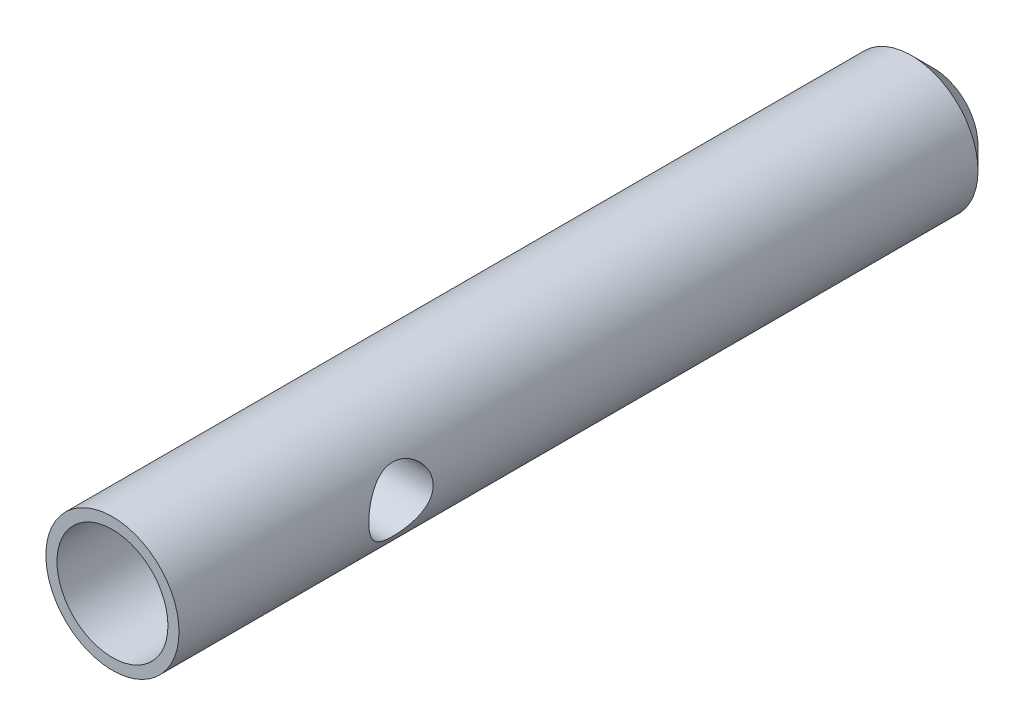
ISO-10303-21;
HEADER;
FILE_DESCRIPTION(('STEP AP214'),'2;1');
FILE_NAME('part.step','',(''),(''),'','','');
FILE_SCHEMA(('AUTOMOTIVE_DESIGN { 1 0 10303 214 1 1 1 1 }'));
ENDSEC;
DATA;
#1=APPLICATION_CONTEXT('core data for automotive mechanical design processes');
#2=APPLICATION_PROTOCOL_DEFINITION('international standard','automotive_design',2000,#1);
#3=PRODUCT_CONTEXT('',#1,'mechanical');
#4=PRODUCT('Part','Part','',(#3));
#5=PRODUCT_RELATED_PRODUCT_CATEGORY('part','',(#4));
#6=PRODUCT_DEFINITION_FORMATION('','',#4);
#7=PRODUCT_DEFINITION_CONTEXT('part definition',#1,'design');
#8=PRODUCT_DEFINITION('design','',#6,#7);
#9=PRODUCT_DEFINITION_SHAPE('','',#8);
#10=(LENGTH_UNIT() NAMED_UNIT(*) SI_UNIT(.MILLI.,.METRE.));
#11=(NAMED_UNIT(*) PLANE_ANGLE_UNIT() SI_UNIT($,.RADIAN.));
#12=(NAMED_UNIT(*) SI_UNIT($,.STERADIAN.) SOLID_ANGLE_UNIT());
#13=UNCERTAINTY_MEASURE_WITH_UNIT(LENGTH_MEASURE(1.E-05),#10,'distance_accuracy_value','');
#14=(GEOMETRIC_REPRESENTATION_CONTEXT(3) GLOBAL_UNCERTAINTY_ASSIGNED_CONTEXT((#13)) GLOBAL_UNIT_ASSIGNED_CONTEXT((#10,
#11,#12)) REPRESENTATION_CONTEXT('',''));
#15=CARTESIAN_POINT('',(0.,0.,0.));
#16=DIRECTION('',(0.,0.,1.));
#17=DIRECTION('',(1.,0.,0.));
#18=AXIS2_PLACEMENT_3D('',#15,#16,#17);
#19=CARTESIAN_POINT('',(0.,0.,37.));
#20=DIRECTION('',(0.,0.,-1.));
#21=DIRECTION('',(-1.,0.,0.));
#22=AXIS2_PLACEMENT_3D('',#19,#20,#21);
#23=CYLINDRICAL_SURFACE('',#22,3.);
#24=CARTESIAN_POINT('',(-3.,0.,25.55));
#25=CARTESIAN_POINT('',(-2.99999612081298,0.0765307274979416,25.5500045405193));
#26=CARTESIAN_POINT('',(-2.99703967394009,0.153161642735378,25.5560945879909));
#27=CARTESIAN_POINT('',(-2.98550501152449,0.304177604644465,25.5801943768202));
#28=CARTESIAN_POINT('',(-2.97691520396142,0.378557688801597,25.5982286972059));
#29=CARTESIAN_POINT('',(-2.9550169031266,0.52265346658165,25.6453572298512));
#30=CARTESIAN_POINT('',(-2.94172634014956,0.592385703895517,25.6744094460817));
#31=CARTESIAN_POINT('',(-2.91166102341307,0.725892100939563,25.7425412652125));
#32=CARTESIAN_POINT('',(-2.89488669768938,0.789666991230455,25.7816196363786));
#33=CARTESIAN_POINT('',(-2.85828185236896,0.913584245144568,25.8712643449592));
#34=CARTESIAN_POINT('',(-2.83833092337698,0.973305533119433,25.9223628970886));
#35=CARTESIAN_POINT('',(-2.79803945446581,1.0837139061515,26.0334573078884));
#36=CARTESIAN_POINT('',(-2.77769864962032,1.13439458820743,26.0934594178325));
#37=CARTESIAN_POINT('',(-2.73727073702847,1.22889240144532,26.2257950833783));
#38=CARTESIAN_POINT('',(-2.7173048647613,1.27196367592979,26.2987025278169));
#39=CARTESIAN_POINT('',(-2.68188338301647,1.34505108316872,26.4518040681357));
#40=CARTESIAN_POINT('',(-2.66642471915123,1.37507606376593,26.5319931809142));
#41=CARTESIAN_POINT('',(-2.64311522038543,1.41934460077888,26.6926111652423));
#42=CARTESIAN_POINT('',(-2.63487517137381,1.43440239745371,26.7727564353587));
#43=CARTESIAN_POINT('',(-2.62587653771564,1.45081708073883,26.9348250536738));
#44=CARTESIAN_POINT('',(-2.625111392162,1.45218598245471,27.0167467793141));
#45=CARTESIAN_POINT('',(-2.63083206405466,1.44178396367734,27.1703772023389));
#46=CARTESIAN_POINT('',(-2.63653015218159,1.43144073903634,27.2422187611512));
#47=CARTESIAN_POINT('',(-2.65316520459532,1.40036487654895,27.3829827717398));
#48=CARTESIAN_POINT('',(-2.66410366451324,1.37962927258196,27.4519043840311));
#49=CARTESIAN_POINT('',(-2.69023571019652,1.32796190942694,27.5868222160692));
#50=CARTESIAN_POINT('',(-2.70552247128007,1.2968039127114,27.6527129076692));
#51=CARTESIAN_POINT('',(-2.73862686619464,1.22534556534202,27.7786368102176));
#52=CARTESIAN_POINT('',(-2.75644562509711,1.18504114577511,27.8386673971671));
#53=CARTESIAN_POINT('',(-2.79513932815918,1.0909059718213,27.9585904788013));
#54=CARTESIAN_POINT('',(-2.81612741275565,1.03604250149277,28.0176385665667));
#55=CARTESIAN_POINT('',(-2.85708426031966,0.917075343074329,28.1260336767916));
#56=CARTESIAN_POINT('',(-2.87705259314359,0.852967798611948,28.1753766301267));
#57=CARTESIAN_POINT('',(-2.91471885551593,0.714000963992316,28.2648322378198));
#58=CARTESIAN_POINT('',(-2.93229107655916,0.638809950962981,28.3044867153606));
#59=CARTESIAN_POINT('',(-2.96214084082005,0.48175794107364,28.3702707725635));
#60=CARTESIAN_POINT('',(-2.97442232399267,0.39990196174367,28.3964104194871));
#61=CARTESIAN_POINT('',(-2.99149074518219,0.238788194513551,28.4323915821561));
#62=CARTESIAN_POINT('',(-2.99679351595986,0.159836780687537,28.4433584162994));
#63=CARTESIAN_POINT('',(-3.00104912370166,0.00104727212449658,28.4521754425244));
#64=CARTESIAN_POINT('',(-3.00000468355028,-0.0787904277354053,28.4500312590876));
#65=CARTESIAN_POINT('',(-2.99199281350272,-0.231041699195564,28.4333755874306));
#66=CARTESIAN_POINT('',(-2.98545325282241,-0.303578577529127,28.4197573111068));
#67=CARTESIAN_POINT('',(-2.96764024286646,-0.445205658807543,28.381906867184));
#68=CARTESIAN_POINT('',(-2.95636625577126,-0.514295469175788,28.3576734937218));
#69=CARTESIAN_POINT('',(-2.92969647172705,-0.649435554841712,28.2985898512282));
#70=CARTESIAN_POINT('',(-2.91418782119759,-0.715333824030334,28.2634446247957));
#71=CARTESIAN_POINT('',(-2.88057742037419,-0.840524717425349,28.1838608738915));
#72=CARTESIAN_POINT('',(-2.86247454151105,-0.899814446652079,28.1394183008984));
#73=CARTESIAN_POINT('',(-2.8234626779216,-1.01594845859459,28.0377127332999));
#74=CARTESIAN_POINT('',(-2.80244935025403,-1.07205124593029,27.9796413939304));
#75=CARTESIAN_POINT('',(-2.76128527675647,-1.17402466981411,27.8547912119017));
#76=CARTESIAN_POINT('',(-2.74113503731897,-1.2198893641481,27.7880073479128));
#77=CARTESIAN_POINT('',(-2.70323844091546,-1.301776942757,27.6441969618619));
#78=CARTESIAN_POINT('',(-2.68562066156143,-1.3373321590834,27.5668673658673));
#79=CARTESIAN_POINT('',(-2.65636772005657,-1.39454633181697,27.4061896500969));
#80=CARTESIAN_POINT('',(-2.64472537944019,-1.41622196994996,27.322848889697));
#81=CARTESIAN_POINT('',(-2.63011324701133,-1.44316248444081,27.1608710996561));
#82=CARTESIAN_POINT('',(-2.62643457503468,-1.44977184912152,27.0825224836815));
#83=CARTESIAN_POINT('',(-2.62619039680624,-1.45021623758756,26.925790225));
#84=CARTESIAN_POINT('',(-2.62962241574508,-1.44405570581539,26.847406603969));
#85=CARTESIAN_POINT('',(-2.64248035535494,-1.42037023201846,26.6997084358879));
#86=CARTESIAN_POINT('',(-2.65138127826905,-1.40383826193517,26.6301834859031));
#87=CARTESIAN_POINT('',(-2.6735971949962,-1.36104948582567,26.4949475272367));
#88=CARTESIAN_POINT('',(-2.6869135463913,-1.33478968855853,26.4292376988756));
#89=CARTESIAN_POINT('',(-2.71755592132651,-1.27130208969093,26.2986348909379));
#90=CARTESIAN_POINT('',(-2.73509104726921,-1.23345653697834,26.234092613847));
#91=CARTESIAN_POINT('',(-2.77180093726383,-1.14858894319866,26.1118640567804));
#92=CARTESIAN_POINT('',(-2.79097651389737,-1.10156233942563,26.0541812087646));
#93=CARTESIAN_POINT('',(-2.83134850762111,-0.993550269121284,25.9406828543666));
#94=CARTESIAN_POINT('',(-2.85253372552738,-0.931595972289931,25.8857804055507));
#95=CARTESIAN_POINT('',(-2.89255523527256,-0.798708288939405,25.7869793488573));
#96=CARTESIAN_POINT('',(-2.91139034591478,-0.727770422956243,25.7430862633325));
#97=CARTESIAN_POINT('',(-2.94467865113621,-0.578543437348614,25.667793403571));
#98=CARTESIAN_POINT('',(-2.95913047560339,-0.500252029174533,25.6363975347141));
#99=CARTESIAN_POINT('',(-2.98192539561231,-0.338708874975766,25.5876080840824));
#100=CARTESIAN_POINT('',(-2.99028627815326,-0.25547234610191,25.5701737164844));
#101=CARTESIAN_POINT('',(-2.99673174492225,-0.142893528745381,25.5567726387636));
#102=CARTESIAN_POINT('',(-2.997954546114,-0.114392467424232,25.5542360394183));
#103=CARTESIAN_POINT('',(-2.99958940972665,-0.0572656164332232,25.5508488491782));
#104=CARTESIAN_POINT('',(-3.00000145169445,-0.0286398236350072,25.5499983008175));
#105=CARTESIAN_POINT('',(-3.,0.,25.55));
#106=B_SPLINE_CURVE_WITH_KNOTS('',3,(#24,#25,#26,#27,#28,#29,#30,#31,#32,#33,#34,#35,#36,#37,
#38,#39,#40,#41,#42,#43,#44,#45,#46,#47,#48,#49,#50,#51,#52,#53,#54,#55,#56,#57,#58,#59,#60,#61,
#62,#63,#64,#65,#66,#67,#68,#69,#70,#71,#72,#73,#74,#75,#76,#77,#78,#79,#80,#81,#82,#83,#84,#85,
#86,#87,#88,#89,#90,#91,#92,#93,#94,#95,#96,#97,#98,#99,#100,#101,#102,#103,#104,#105),
.UNSPECIFIED.,.T.,.F.,(4,2,2,2,2,2,2,2,2,2,2,2,2,2,2,2,2,2,2,2,2,2,2,2,2,2,2,2,2,2,2,2,2,2,2,2,
2,2,2,2,4),(0.,0.22947557086318,0.459424831854174,0.688506282141685,0.91755960275651,
1.15981165811999,1.40223461290408,1.66192237223259,1.92143373845101,2.16589509779607,
2.4101418680794,2.62754281740569,2.84500585116379,3.06753398921646,3.29016131673734,
3.53893772322278,3.7878182142308,4.04684255861719,4.30567367553667,4.54403791097849,
4.78229989797434,5.00356397823134,5.22485320036184,5.45273911197755,5.68072446364084,
5.9299339676436,6.17928773952589,6.43862695604369,6.69765388739102,6.9324706888598,
7.16720577826903,7.38231982597292,7.5975000747688,7.82711979689807,8.05685392494063,
8.31201128566552,8.56729637980937,8.82266118802034,9.0772772478384,9.16315091326922,
9.2490267450159),.UNSPECIFIED.);
#107=CARTESIAN_POINT('',(-3.,0.,25.55));
#108=VERTEX_POINT('',#107);
#109=EDGE_CURVE('E10',#108,#108,#106,.T.);
#110=ORIENTED_EDGE('',*,*,#109,.T.);
#111=EDGE_LOOP('',(#110));
#112=FACE_BOUND('',#111,.T.);
#113=CARTESIAN_POINT('',(3.,0.,25.55));
#114=CARTESIAN_POINT('',(2.99999612081298,-0.0765307274979416,25.5500045405193));
#115=CARTESIAN_POINT('',(2.99703967394009,-0.153161642735378,25.5560945879909));
#116=CARTESIAN_POINT('',(2.98550501152449,-0.304177604644465,25.5801943768202));
#117=CARTESIAN_POINT('',(2.97691520396142,-0.378557688801597,25.5982286972059));
#118=CARTESIAN_POINT('',(2.9550169031266,-0.522653466581649,25.6453572298512));
#119=CARTESIAN_POINT('',(2.94172634014957,-0.592385703895515,25.6744094460817));
#120=CARTESIAN_POINT('',(2.91166102341307,-0.725892100939561,25.7425412652125));
#121=CARTESIAN_POINT('',(2.89488669768938,-0.789666991230454,25.7816196363786));
#122=CARTESIAN_POINT('',(2.85828185236896,-0.913584245144567,25.8712643449592));
#123=CARTESIAN_POINT('',(2.83833092337698,-0.973305533119432,25.9223628970886));
#124=CARTESIAN_POINT('',(2.79803945446581,-1.0837139061515,26.0334573078884));
#125=CARTESIAN_POINT('',(2.77769864962032,-1.13439458820743,26.0934594178325));
#126=CARTESIAN_POINT('',(2.73727073702847,-1.22889240144532,26.2257950833783));
#127=CARTESIAN_POINT('',(2.7173048647613,-1.27196367592979,26.2987025278169));
#128=CARTESIAN_POINT('',(2.68188338301647,-1.34505108316872,26.4518040681357));
#129=CARTESIAN_POINT('',(2.66642471915123,-1.37507606376593,26.5319931809142));
#130=CARTESIAN_POINT('',(2.64311522038543,-1.41934460077888,26.6926111652423));
#131=CARTESIAN_POINT('',(2.63487517137381,-1.43440239745371,26.7727564353587));
#132=CARTESIAN_POINT('',(2.62587653771564,-1.45081708073883,26.9348250536738));
#133=CARTESIAN_POINT('',(2.625111392162,-1.45218598245471,27.0167467793141));
#134=CARTESIAN_POINT('',(2.63083206405466,-1.44178396367734,27.1703772023389));
#135=CARTESIAN_POINT('',(2.63653015218159,-1.43144073903634,27.2422187611512));
#136=CARTESIAN_POINT('',(2.65316520459532,-1.40036487654895,27.3829827717398));
#137=CARTESIAN_POINT('',(2.66410366451324,-1.37962927258196,27.4519043840311));
#138=CARTESIAN_POINT('',(2.69023571019652,-1.32796190942694,27.5868222160692));
#139=CARTESIAN_POINT('',(2.70552247128007,-1.2968039127114,27.6527129076692));
#140=CARTESIAN_POINT('',(2.73862686619464,-1.22534556534202,27.7786368102176));
#141=CARTESIAN_POINT('',(2.75644562509711,-1.18504114577511,27.8386673971671));
#142=CARTESIAN_POINT('',(2.79513932815918,-1.0909059718213,27.9585904788013));
#143=CARTESIAN_POINT('',(2.81612741275565,-1.03604250149277,28.0176385665667));
#144=CARTESIAN_POINT('',(2.85708426031966,-0.917075343074328,28.1260336767916));
#145=CARTESIAN_POINT('',(2.87705259314359,-0.852967798611948,28.1753766301267));
#146=CARTESIAN_POINT('',(2.91471885551593,-0.714000963992316,28.2648322378198));
#147=CARTESIAN_POINT('',(2.93229107655916,-0.638809950962981,28.3044867153606));
#148=CARTESIAN_POINT('',(2.96214084082005,-0.48175794107364,28.3702707725635));
#149=CARTESIAN_POINT('',(2.97442232399267,-0.39990196174367,28.3964104194871));
#150=CARTESIAN_POINT('',(2.99149074518219,-0.238788194513552,28.4323915821561));
#151=CARTESIAN_POINT('',(2.99679351595986,-0.159836780687537,28.4433584162994));
#152=CARTESIAN_POINT('',(3.00104912370166,-0.00104727212449696,28.4521754425244));
#153=CARTESIAN_POINT('',(3.00000468355028,0.078790427735405,28.4500312590876));
#154=CARTESIAN_POINT('',(2.99199281350272,0.231041699195563,28.4333755874306));
#155=CARTESIAN_POINT('',(2.98545325282241,0.303578577529127,28.4197573111068));
#156=CARTESIAN_POINT('',(2.96764024286646,0.445205658807543,28.381906867184));
#157=CARTESIAN_POINT('',(2.95636625577126,0.514295469175788,28.3576734937218));
#158=CARTESIAN_POINT('',(2.92969647172705,0.649435554841712,28.2985898512282));
#159=CARTESIAN_POINT('',(2.91418782119759,0.715333824030334,28.2634446247957));
#160=CARTESIAN_POINT('',(2.88057742037419,0.840524717425349,28.1838608738915));
#161=CARTESIAN_POINT('',(2.86247454151105,0.899814446652079,28.1394183008984));
#162=CARTESIAN_POINT('',(2.8234626779216,1.01594845859459,28.0377127332999));
#163=CARTESIAN_POINT('',(2.80244935025403,1.07205124593029,27.9796413939304));
#164=CARTESIAN_POINT('',(2.76128527675647,1.17402466981411,27.8547912119017));
#165=CARTESIAN_POINT('',(2.74113503731897,1.2198893641481,27.7880073479128));
#166=CARTESIAN_POINT('',(2.70323844091546,1.301776942757,27.6441969618619));
#167=CARTESIAN_POINT('',(2.68562066156143,1.3373321590834,27.5668673658673));
#168=CARTESIAN_POINT('',(2.65636772005657,1.39454633181697,27.4061896500969));
#169=CARTESIAN_POINT('',(2.64472537944019,1.41622196994996,27.322848889697));
#170=CARTESIAN_POINT('',(2.63011324701133,1.44316248444081,27.1608710996561));
#171=CARTESIAN_POINT('',(2.62643457503468,1.44977184912152,27.0825224836815));
#172=CARTESIAN_POINT('',(2.62619039680624,1.45021623758756,26.925790225));
#173=CARTESIAN_POINT('',(2.62962241574508,1.44405570581539,26.847406603969));
#174=CARTESIAN_POINT('',(2.64248035535494,1.42037023201846,26.6997084358879));
#175=CARTESIAN_POINT('',(2.65138127826905,1.40383826193517,26.6301834859031));
#176=CARTESIAN_POINT('',(2.6735971949962,1.36104948582567,26.4949475272367));
#177=CARTESIAN_POINT('',(2.6869135463913,1.33478968855853,26.4292376988756));
#178=CARTESIAN_POINT('',(2.71755592132651,1.27130208969093,26.2986348909379));
#179=CARTESIAN_POINT('',(2.73509104726921,1.23345653697834,26.234092613847));
#180=CARTESIAN_POINT('',(2.77180093726383,1.14858894319866,26.1118640567804));
#181=CARTESIAN_POINT('',(2.79097651389737,1.10156233942563,26.0541812087646));
#182=CARTESIAN_POINT('',(2.83134850762111,0.993550269121284,25.9406828543666));
#183=CARTESIAN_POINT('',(2.85253372552738,0.931595972289931,25.8857804055507));
#184=CARTESIAN_POINT('',(2.89255523527256,0.798708288939405,25.7869793488573));
#185=CARTESIAN_POINT('',(2.91139034591478,0.727770422956243,25.7430862633325));
#186=CARTESIAN_POINT('',(2.94467865113621,0.578543437348614,25.667793403571));
#187=CARTESIAN_POINT('',(2.95913047560339,0.500252029174533,25.6363975347141));
#188=CARTESIAN_POINT('',(2.98192539561231,0.338708874975766,25.5876080840824));
#189=CARTESIAN_POINT('',(2.99028627815326,0.25547234610191,25.5701737164844));
#190=CARTESIAN_POINT('',(2.99673174492225,0.142893528745381,25.5567726387636));
#191=CARTESIAN_POINT('',(2.997954546114,0.114392467424232,25.5542360394183));
#192=CARTESIAN_POINT('',(2.99958940972665,0.0572656164332232,25.5508488491782));
#193=CARTESIAN_POINT('',(3.00000145169445,0.0286398236350072,25.5499983008175));
#194=CARTESIAN_POINT('',(3.,0.,25.55));
#195=B_SPLINE_CURVE_WITH_KNOTS('',3,(#113,#114,#115,#116,#117,#118,#119,#120,#121,#122,#123,
#124,#125,#126,#127,#128,#129,#130,#131,#132,#133,#134,#135,#136,#137,#138,#139,#140,#141,#142,
#143,#144,#145,#146,#147,#148,#149,#150,#151,#152,#153,#154,#155,#156,#157,#158,#159,#160,#161,
#162,#163,#164,#165,#166,#167,#168,#169,#170,#171,#172,#173,#174,#175,#176,#177,#178,#179,#180,
#181,#182,#183,#184,#185,#186,#187,#188,#189,#190,#191,#192,#193,#194),.UNSPECIFIED.,.T.,.F.,(4,
2,2,2,2,2,2,2,2,2,2,2,2,2,2,2,2,2,2,2,2,2,2,2,2,2,2,2,2,2,2,2,2,2,2,2,2,2,2,2,4),(0.,
0.22947557086318,0.459424831854174,0.68850628214168,0.91755960275651,1.15981165811999,
1.40223461290408,1.66192237223259,1.92143373845101,2.16589509779607,2.4101418680794,
2.62754281740569,2.84500585116379,3.06753398921646,3.29016131673734,3.53893772322278,
3.7878182142308,4.0468425586172,4.30567367553667,4.54403791097849,4.78229989797434,
5.00356397823134,5.22485320036184,5.45273911197755,5.68072446364084,5.9299339676436,
6.17928773952589,6.43862695604369,6.69765388739102,6.9324706888598,7.16720577826903,
7.38231982597292,7.5975000747688,7.82711979689807,8.05685392494063,8.31201128566552,
8.56729637980937,8.82266118802034,9.0772772478384,9.16315091326922,9.2490267450159),.UNSPECIFIED.);
#196=CARTESIAN_POINT('',(3.,0.,25.55));
#197=VERTEX_POINT('',#196);
#198=EDGE_CURVE('E47',#197,#197,#195,.T.);
#199=ORIENTED_EDGE('',*,*,#198,.T.);
#200=EDGE_LOOP('',(#199));
#201=FACE_BOUND('',#200,.T.);
#202=CARTESIAN_POINT('',(0.,0.,0.999999999999994));
#203=DIRECTION('',(0.,0.,1.));
#204=DIRECTION('',(1.,0.,0.));
#205=AXIS2_PLACEMENT_3D('',#202,#203,#204);
#206=CIRCLE('',#205,3.);
#207=CARTESIAN_POINT('',(3.,0.,0.999999999999994));
#208=VERTEX_POINT('',#207);
#209=EDGE_CURVE('E55',#208,#208,#206,.T.);
#210=ORIENTED_EDGE('',*,*,#209,.T.);
#211=EDGE_LOOP('',(#210));
#212=FACE_BOUND('',#211,.T.);
#213=CARTESIAN_POINT('',(0.,0.,37.));
#214=DIRECTION('',(0.,0.,1.));
#215=DIRECTION('',(1.,0.,0.));
#216=AXIS2_PLACEMENT_3D('',#213,#214,#215);
#217=CIRCLE('',#216,3.);
#218=CARTESIAN_POINT('',(3.,0.,37.));
#219=VERTEX_POINT('',#218);
#220=EDGE_CURVE('E93',#219,#219,#217,.T.);
#221=ORIENTED_EDGE('',*,*,#220,.F.);
#222=EDGE_LOOP('',(#221));
#223=FACE_BOUND('',#222,.T.);
#224=ADVANCED_FACE('F37',(#112,#201,#212,#223),#23,.T.);
#225=CARTESIAN_POINT('',(0.,0.,37.));
#226=DIRECTION('',(0.,0.,1.));
#227=DIRECTION('',(1.,0.,0.));
#228=AXIS2_PLACEMENT_3D('',#225,#226,#227);
#229=PLANE('',#228);
#230=CARTESIAN_POINT('',(0.,0.,37.));
#231=DIRECTION('',(0.,0.,1.));
#232=DIRECTION('',(1.,0.,0.));
#233=AXIS2_PLACEMENT_3D('',#230,#231,#232);
#234=CIRCLE('',#233,2.5);
#235=CARTESIAN_POINT('',(2.5,0.,37.));
#236=VERTEX_POINT('',#235);
#237=EDGE_CURVE('E98',#236,#236,#234,.T.);
#238=ORIENTED_EDGE('',*,*,#237,.F.);
#239=EDGE_LOOP('',(#238));
#240=FACE_BOUND('',#239,.T.);
#241=ORIENTED_EDGE('',*,*,#220,.T.);
#242=EDGE_LOOP('',(#241));
#243=FACE_BOUND('',#242,.T.);
#244=ADVANCED_FACE('F77',(#240,#243),#229,.T.);
#245=CARTESIAN_POINT('',(0.,0.,0.));
#246=DIRECTION('',(0.,0.,1.));
#247=DIRECTION('',(1.,0.,0.));
#248=AXIS2_PLACEMENT_3D('',#245,#246,#247);
#249=PLANE('',#248);
#250=CARTESIAN_POINT('',(0.,0.,0.));
#251=DIRECTION('',(0.,0.,1.));
#252=DIRECTION('',(1.,0.,0.));
#253=AXIS2_PLACEMENT_3D('',#250,#251,#252);
#254=CIRCLE('',#253,2.);
#255=CARTESIAN_POINT('',(2.,0.,0.));
#256=VERTEX_POINT('',#255);
#257=EDGE_CURVE('E51',#256,#256,#254,.F.);
#258=ORIENTED_EDGE('',*,*,#257,.T.);
#259=EDGE_LOOP('',(#258));
#260=FACE_BOUND('',#259,.T.);
#261=ADVANCED_FACE('F75',(#260),#249,.F.);
#262=CARTESIAN_POINT('',(0.,0.,31.));
#263=DIRECTION('',(0.,0.,1.));
#264=DIRECTION('',(1.,0.,0.));
#265=AXIS2_PLACEMENT_3D('',#262,#263,#264);
#266=CYLINDRICAL_SURFACE('',#265,2.5);
#267=CARTESIAN_POINT('',(0.,0.,31.));
#268=DIRECTION('',(0.,0.,1.));
#269=DIRECTION('',(1.,0.,0.));
#270=AXIS2_PLACEMENT_3D('',#267,#268,#269);
#271=CIRCLE('',#270,2.5);
#272=CARTESIAN_POINT('',(2.5,0.,31.));
#273=VERTEX_POINT('',#272);
#274=EDGE_CURVE('E95',#273,#273,#271,.T.);
#275=ORIENTED_EDGE('',*,*,#274,.F.);
#276=EDGE_LOOP('',(#275));
#277=FACE_BOUND('',#276,.T.);
#278=ORIENTED_EDGE('',*,*,#237,.T.);
#279=EDGE_LOOP('',(#278));
#280=FACE_BOUND('',#279,.T.);
#281=ADVANCED_FACE('F71',(#277,#280),#266,.F.);
#282=CARTESIAN_POINT('',(0.,0.,31.));
#283=DIRECTION('',(0.,0.,1.));
#284=DIRECTION('',(1.,0.,0.));
#285=AXIS2_PLACEMENT_3D('',#282,#283,#284);
#286=PLANE('',#285);
#287=ORIENTED_EDGE('',*,*,#274,.T.);
#288=EDGE_LOOP('',(#287));
#289=FACE_BOUND('',#288,.T.);
#290=ADVANCED_FACE('F67',(#289),#286,.T.);
#291=CARTESIAN_POINT('',(0.,0.,0.999999999999994));
#292=DIRECTION('',(0.,0.,1.));
#293=DIRECTION('',(1.,0.,0.));
#294=AXIS2_PLACEMENT_3D('',#291,#292,#293);
#295=CONICAL_SURFACE('',#294,3.,0.78539816339745);
#296=ORIENTED_EDGE('',*,*,#257,.F.);
#297=EDGE_LOOP('',(#296));
#298=FACE_BOUND('',#297,.T.);
#299=ORIENTED_EDGE('',*,*,#209,.F.);
#300=EDGE_LOOP('',(#299));
#301=FACE_BOUND('',#300,.T.);
#302=ADVANCED_FACE('F39',(#298,#301),#295,.T.);
#303=CARTESIAN_POINT('',(3.,0.,27.));
#304=DIRECTION('',(1.,0.,0.));
#305=DIRECTION('',(0.,0.,-1.));
#306=AXIS2_PLACEMENT_3D('',#303,#304,#305);
#307=CYLINDRICAL_SURFACE('',#306,1.44999999999999);
#308=ORIENTED_EDGE('',*,*,#198,.F.);
#309=EDGE_LOOP('',(#308));
#310=FACE_BOUND('',#309,.T.);
#311=ORIENTED_EDGE('',*,*,#109,.F.);
#312=EDGE_LOOP('',(#311));
#313=FACE_BOUND('',#312,.T.);
#314=ADVANCED_FACE('F62',(#310,#313),#307,.F.);
#315=CLOSED_SHELL('',(#224,#244,#261,#281,#290,#302,#314));
#316=MANIFOLD_SOLID_BREP('B2',#315);
#317=ADVANCED_BREP_SHAPE_REPRESENTATION('',(#18,#316),#14);
#318=SHAPE_DEFINITION_REPRESENTATION(#9,#317);
ENDSEC;
END-ISO-10303-21;
